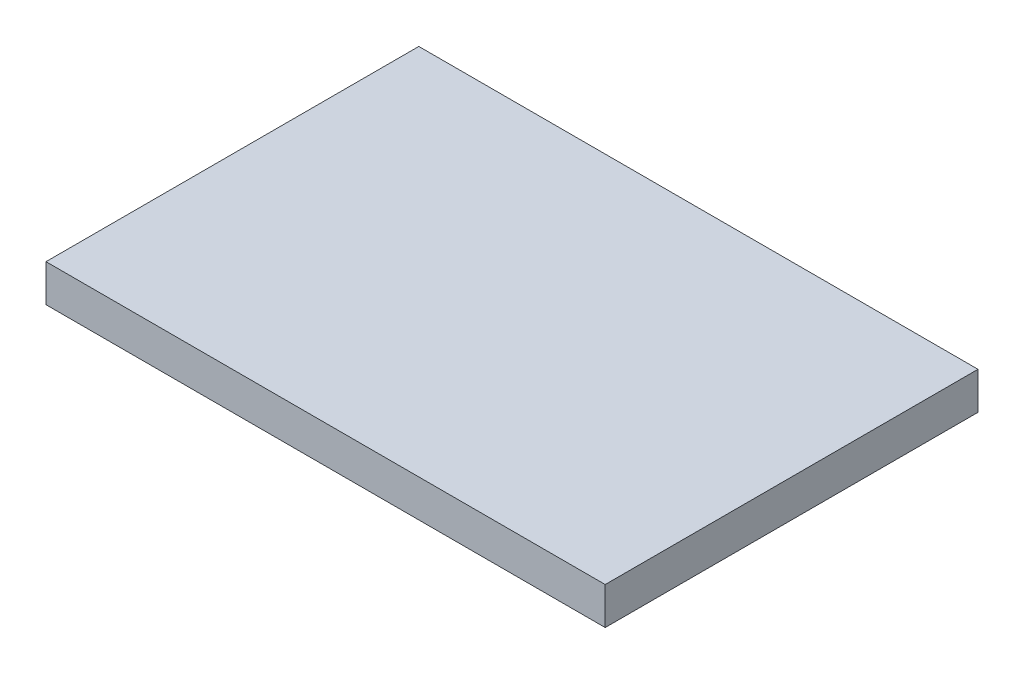
ISO-10303-21;
HEADER;
FILE_DESCRIPTION(('STEP AP214'),'2;1');
FILE_NAME('part.step','',(''),(''),'','','');
FILE_SCHEMA(('AUTOMOTIVE_DESIGN { 1 0 10303 214 1 1 1 1 }'));
ENDSEC;
DATA;
#1=APPLICATION_CONTEXT('core data for automotive mechanical design processes');
#2=APPLICATION_PROTOCOL_DEFINITION('international standard','automotive_design',2000,#1);
#3=PRODUCT_CONTEXT('',#1,'mechanical');
#4=PRODUCT('Part','Part','',(#3));
#5=PRODUCT_RELATED_PRODUCT_CATEGORY('part','',(#4));
#6=PRODUCT_DEFINITION_FORMATION('','',#4);
#7=PRODUCT_DEFINITION_CONTEXT('part definition',#1,'design');
#8=PRODUCT_DEFINITION('design','',#6,#7);
#9=PRODUCT_DEFINITION_SHAPE('','',#8);
#10=(LENGTH_UNIT() NAMED_UNIT(*) SI_UNIT(.MILLI.,.METRE.));
#11=(NAMED_UNIT(*) PLANE_ANGLE_UNIT() SI_UNIT($,.RADIAN.));
#12=(NAMED_UNIT(*) SI_UNIT($,.STERADIAN.) SOLID_ANGLE_UNIT());
#13=UNCERTAINTY_MEASURE_WITH_UNIT(LENGTH_MEASURE(1.E-05),#10,'distance_accuracy_value','');
#14=(GEOMETRIC_REPRESENTATION_CONTEXT(3) GLOBAL_UNCERTAINTY_ASSIGNED_CONTEXT((#13)) GLOBAL_UNIT_ASSIGNED_CONTEXT((#10,
#11,#12)) REPRESENTATION_CONTEXT('',''));
#15=CARTESIAN_POINT('',(0.,0.,0.));
#16=DIRECTION('',(0.,0.,1.));
#17=DIRECTION('',(1.,0.,0.));
#18=AXIS2_PLACEMENT_3D('',#15,#16,#17);
#19=CARTESIAN_POINT('',(0.,5.,0.));
#20=DIRECTION('',(1.,0.,0.));
#21=DIRECTION('',(0.,0.,-1.));
#22=AXIS2_PLACEMENT_3D('',#19,#20,#21);
#23=PLANE('',#22);
#24=DIRECTION('',(0.,0.,1.));
#25=VECTOR('',#24,1.);
#26=CARTESIAN_POINT('',(0.,0.,0.));
#27=LINE('',#26,#25);
#28=CARTESIAN_POINT('',(0.,0.,-50.));
#29=VERTEX_POINT('',#28);
#30=CARTESIAN_POINT('',(0.,0.,0.));
#31=VERTEX_POINT('',#30);
#32=EDGE_CURVE('E98',#29,#31,#27,.T.);
#33=ORIENTED_EDGE('',*,*,#32,.T.);
#34=DIRECTION('',(0.,-1.,0.));
#35=VECTOR('',#34,1.);
#36=CARTESIAN_POINT('',(0.,5.,0.));
#37=LINE('',#36,#35);
#38=CARTESIAN_POINT('',(0.,5.,0.));
#39=VERTEX_POINT('',#38);
#40=EDGE_CURVE('E11',#39,#31,#37,.T.);
#41=ORIENTED_EDGE('',*,*,#40,.F.);
#42=DIRECTION('',(0.,0.,1.));
#43=VECTOR('',#42,1.);
#44=CARTESIAN_POINT('',(0.,5.,0.));
#45=LINE('',#44,#43);
#46=CARTESIAN_POINT('',(0.,5.,-50.));
#47=VERTEX_POINT('',#46);
#48=EDGE_CURVE('E86',#47,#39,#45,.T.);
#49=ORIENTED_EDGE('',*,*,#48,.F.);
#50=DIRECTION('',(0.,-1.,0.));
#51=VECTOR('',#50,1.);
#52=CARTESIAN_POINT('',(0.,5.,-50.));
#53=LINE('',#52,#51);
#54=EDGE_CURVE('E94',#47,#29,#53,.T.);
#55=ORIENTED_EDGE('',*,*,#54,.T.);
#56=EDGE_LOOP('',(#33,#41,#49,#55));
#57=FACE_BOUND('',#56,.T.);
#58=ADVANCED_FACE('F35',(#57),#23,.F.);
#59=CARTESIAN_POINT('',(0.,5.,0.));
#60=DIRECTION('',(0.,0.,-1.));
#61=DIRECTION('',(-1.,0.,0.));
#62=AXIS2_PLACEMENT_3D('',#59,#60,#61);
#63=PLANE('',#62);
#64=DIRECTION('',(1.,0.,0.));
#65=VECTOR('',#64,1.);
#66=CARTESIAN_POINT('',(0.,0.,0.));
#67=LINE('',#66,#65);
#68=CARTESIAN_POINT('',(75.,0.,0.));
#69=VERTEX_POINT('',#68);
#70=EDGE_CURVE('E90',#31,#69,#67,.T.);
#71=ORIENTED_EDGE('',*,*,#70,.T.);
#72=DIRECTION('',(0.,-1.,0.));
#73=VECTOR('',#72,1.);
#74=CARTESIAN_POINT('',(75.,5.,0.));
#75=LINE('',#74,#73);
#76=CARTESIAN_POINT('',(75.,5.,0.));
#77=VERTEX_POINT('',#76);
#78=EDGE_CURVE('E43',#77,#69,#75,.T.);
#79=ORIENTED_EDGE('',*,*,#78,.F.);
#80=DIRECTION('',(1.,0.,0.));
#81=VECTOR('',#80,1.);
#82=CARTESIAN_POINT('',(0.,5.,0.));
#83=LINE('',#82,#81);
#84=EDGE_CURVE('E81',#39,#77,#83,.T.);
#85=ORIENTED_EDGE('',*,*,#84,.F.);
#86=ORIENTED_EDGE('',*,*,#40,.T.);
#87=EDGE_LOOP('',(#71,#79,#85,#86));
#88=FACE_BOUND('',#87,.T.);
#89=ADVANCED_FACE('F89',(#88),#63,.F.);
#90=CARTESIAN_POINT('',(75.,5.,0.));
#91=DIRECTION('',(-1.,0.,0.));
#92=DIRECTION('',(0.,0.,1.));
#93=AXIS2_PLACEMENT_3D('',#90,#91,#92);
#94=PLANE('',#93);
#95=DIRECTION('',(0.,0.,-1.));
#96=VECTOR('',#95,1.);
#97=CARTESIAN_POINT('',(75.,0.,0.));
#98=LINE('',#97,#96);
#99=CARTESIAN_POINT('',(75.,0.,-50.));
#100=VERTEX_POINT('',#99);
#101=EDGE_CURVE('E68',#69,#100,#98,.T.);
#102=ORIENTED_EDGE('',*,*,#101,.T.);
#103=DIRECTION('',(0.,-1.,0.));
#104=VECTOR('',#103,1.);
#105=CARTESIAN_POINT('',(75.,5.,-50.));
#106=LINE('',#105,#104);
#107=CARTESIAN_POINT('',(75.,5.,-50.));
#108=VERTEX_POINT('',#107);
#109=EDGE_CURVE('E91',#108,#100,#106,.T.);
#110=ORIENTED_EDGE('',*,*,#109,.F.);
#111=DIRECTION('',(0.,0.,-1.));
#112=VECTOR('',#111,1.);
#113=CARTESIAN_POINT('',(75.,5.,0.));
#114=LINE('',#113,#112);
#115=EDGE_CURVE('E84',#77,#108,#114,.T.);
#116=ORIENTED_EDGE('',*,*,#115,.F.);
#117=ORIENTED_EDGE('',*,*,#78,.T.);
#118=EDGE_LOOP('',(#102,#110,#116,#117));
#119=FACE_BOUND('',#118,.T.);
#120=ADVANCED_FACE('F92',(#119),#94,.F.);
#121=CARTESIAN_POINT('',(0.,5.,-50.));
#122=DIRECTION('',(0.,0.,1.));
#123=DIRECTION('',(1.,0.,0.));
#124=AXIS2_PLACEMENT_3D('',#121,#122,#123);
#125=PLANE('',#124);
#126=DIRECTION('',(-1.,0.,0.));
#127=VECTOR('',#126,1.);
#128=CARTESIAN_POINT('',(0.,0.,-50.));
#129=LINE('',#128,#127);
#130=EDGE_CURVE('E74',#100,#29,#129,.T.);
#131=ORIENTED_EDGE('',*,*,#130,.T.);
#132=ORIENTED_EDGE('',*,*,#54,.F.);
#133=DIRECTION('',(-1.,0.,0.));
#134=VECTOR('',#133,1.);
#135=CARTESIAN_POINT('',(0.,5.,-50.));
#136=LINE('',#135,#134);
#137=EDGE_CURVE('E51',#108,#47,#136,.T.);
#138=ORIENTED_EDGE('',*,*,#137,.F.);
#139=ORIENTED_EDGE('',*,*,#109,.T.);
#140=EDGE_LOOP('',(#131,#132,#138,#139));
#141=FACE_BOUND('',#140,.T.);
#142=ADVANCED_FACE('F105',(#141),#125,.F.);
#143=CARTESIAN_POINT('',(0.,5.,0.));
#144=DIRECTION('',(0.,-1.,0.));
#145=DIRECTION('',(0.,0.,-1.));
#146=AXIS2_PLACEMENT_3D('',#143,#144,#145);
#147=PLANE('',#146);
#148=ORIENTED_EDGE('',*,*,#48,.T.);
#149=ORIENTED_EDGE('',*,*,#84,.T.);
#150=ORIENTED_EDGE('',*,*,#115,.T.);
#151=ORIENTED_EDGE('',*,*,#137,.T.);
#152=EDGE_LOOP('',(#148,#149,#150,#151));
#153=FACE_BOUND('',#152,.T.);
#154=ADVANCED_FACE('F82',(#153),#147,.F.);
#155=CARTESIAN_POINT('',(0.,0.,0.));
#156=DIRECTION('',(0.,-1.,0.));
#157=DIRECTION('',(0.,0.,-1.));
#158=AXIS2_PLACEMENT_3D('',#155,#156,#157);
#159=PLANE('',#158);
#160=ORIENTED_EDGE('',*,*,#32,.F.);
#161=ORIENTED_EDGE('',*,*,#130,.F.);
#162=ORIENTED_EDGE('',*,*,#101,.F.);
#163=ORIENTED_EDGE('',*,*,#70,.F.);
#164=EDGE_LOOP('',(#160,#161,#162,#163));
#165=FACE_BOUND('',#164,.T.);
#166=ADVANCED_FACE('F108',(#165),#159,.T.);
#167=CLOSED_SHELL('',(#58,#89,#120,#142,#154,#166));
#168=MANIFOLD_SOLID_BREP('B2',#167);
#169=ADVANCED_BREP_SHAPE_REPRESENTATION('',(#18,#168),#14);
#170=SHAPE_DEFINITION_REPRESENTATION(#9,#169);
ENDSEC;
END-ISO-10303-21;
